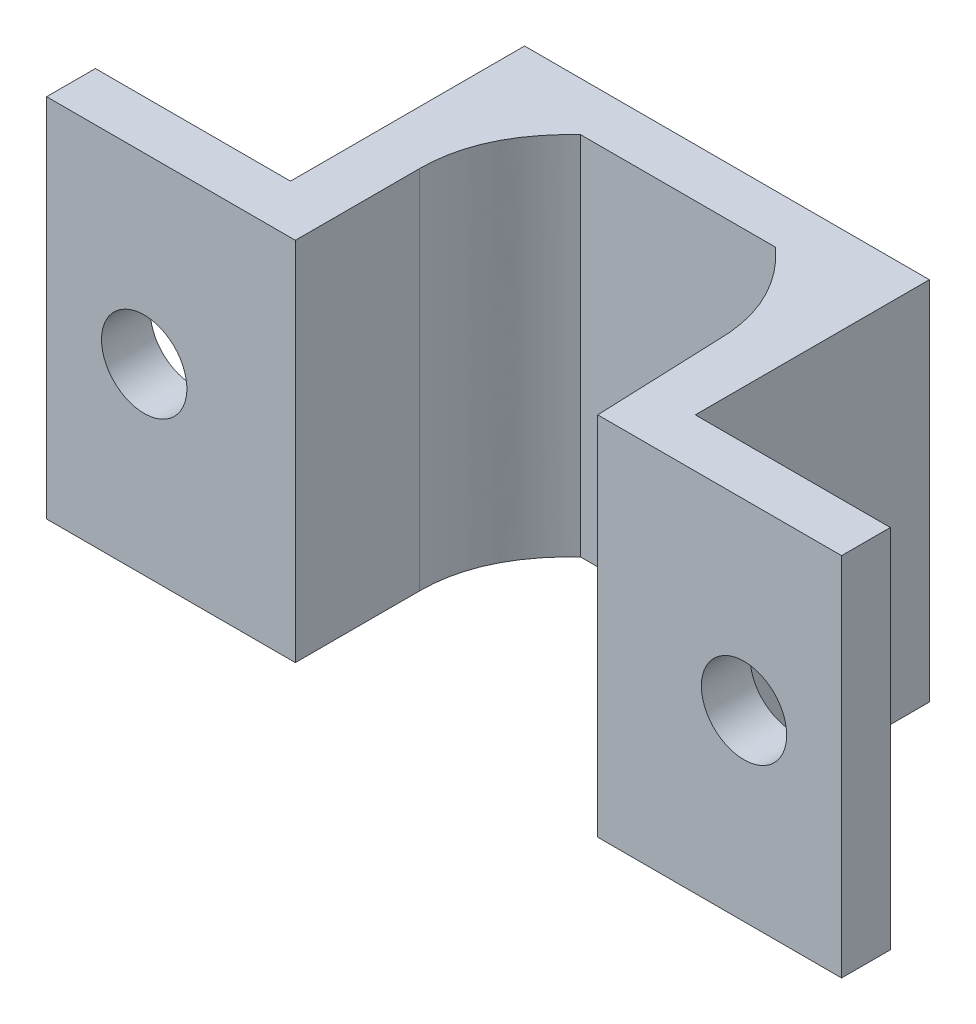
ISO-10303-21;
HEADER;
FILE_DESCRIPTION(('STEP AP214'),'2;1');
FILE_NAME('part.step','',(''),(''),'','','');
FILE_SCHEMA(('AUTOMOTIVE_DESIGN { 1 0 10303 214 1 1 1 1 }'));
ENDSEC;
DATA;
#1=APPLICATION_CONTEXT('core data for automotive mechanical design processes');
#2=APPLICATION_PROTOCOL_DEFINITION('international standard','automotive_design',2000,#1);
#3=PRODUCT_CONTEXT('',#1,'mechanical');
#4=PRODUCT('Part','Part','',(#3));
#5=PRODUCT_RELATED_PRODUCT_CATEGORY('part','',(#4));
#6=PRODUCT_DEFINITION_FORMATION('','',#4);
#7=PRODUCT_DEFINITION_CONTEXT('part definition',#1,'design');
#8=PRODUCT_DEFINITION('design','',#6,#7);
#9=PRODUCT_DEFINITION_SHAPE('','',#8);
#10=(LENGTH_UNIT() NAMED_UNIT(*) SI_UNIT(.MILLI.,.METRE.));
#11=(NAMED_UNIT(*) PLANE_ANGLE_UNIT() SI_UNIT($,.RADIAN.));
#12=(NAMED_UNIT(*) SI_UNIT($,.STERADIAN.) SOLID_ANGLE_UNIT());
#13=UNCERTAINTY_MEASURE_WITH_UNIT(LENGTH_MEASURE(1.E-05),#10,'distance_accuracy_value','');
#14=(GEOMETRIC_REPRESENTATION_CONTEXT(3) GLOBAL_UNCERTAINTY_ASSIGNED_CONTEXT((#13)) GLOBAL_UNIT_ASSIGNED_CONTEXT((#10,
#11,#12)) REPRESENTATION_CONTEXT('',''));
#15=CARTESIAN_POINT('',(0.,0.,0.));
#16=DIRECTION('',(0.,0.,1.));
#17=DIRECTION('',(1.,0.,0.));
#18=AXIS2_PLACEMENT_3D('',#15,#16,#17);
#19=CARTESIAN_POINT('',(0.200000000000002,15.,-5.1));
#20=DIRECTION('',(-1.,0.,0.));
#21=DIRECTION('',(0.,0.,1.));
#22=AXIS2_PLACEMENT_3D('',#19,#20,#21);
#23=PLANE('',#22);
#24=DIRECTION('',(0.,0.,-1.));
#25=VECTOR('',#24,1.);
#26=CARTESIAN_POINT('',(0.200000000000002,0.,-5.1));
#27=LINE('',#26,#25);
#28=CARTESIAN_POINT('',(0.200000000000002,0.,0.));
#29=VERTEX_POINT('',#28);
#30=CARTESIAN_POINT('',(0.200000000000002,0.,-5.1));
#31=VERTEX_POINT('',#30);
#32=EDGE_CURVE('E170',#29,#31,#27,.T.);
#33=ORIENTED_EDGE('',*,*,#32,.T.);
#34=DIRECTION('',(0.,-1.,0.));
#35=VECTOR('',#34,1.);
#36=CARTESIAN_POINT('',(0.200000000000002,15.,-5.1));
#37=LINE('',#36,#35);
#38=CARTESIAN_POINT('',(0.200000000000002,15.,-5.1));
#39=VERTEX_POINT('',#38);
#40=EDGE_CURVE('E42',#39,#31,#37,.T.);
#41=ORIENTED_EDGE('',*,*,#40,.F.);
#42=DIRECTION('',(0.,0.,-1.));
#43=VECTOR('',#42,1.);
#44=CARTESIAN_POINT('',(0.200000000000002,15.,-5.1));
#45=LINE('',#44,#43);
#46=CARTESIAN_POINT('',(0.200000000000002,15.,0.));
#47=VERTEX_POINT('',#46);
#48=EDGE_CURVE('E112',#47,#39,#45,.T.);
#49=ORIENTED_EDGE('',*,*,#48,.F.);
#50=DIRECTION('',(0.,-1.,0.));
#51=VECTOR('',#50,1.);
#52=CARTESIAN_POINT('',(0.200000000000002,15.,0.));
#53=LINE('',#52,#51);
#54=EDGE_CURVE('E11',#47,#29,#53,.T.);
#55=ORIENTED_EDGE('',*,*,#54,.T.);
#56=EDGE_LOOP('',(#33,#41,#49,#55));
#57=FACE_BOUND('',#56,.T.);
#58=ADVANCED_FACE('F33',(#57),#23,.F.);
#59=CARTESIAN_POINT('',(0.200000000000002,15.,-5.1));
#60=CARTESIAN_POINT('',(0.200000000000002,15.,-7.65));
#61=CARTESIAN_POINT('',(2.3,15.,-9.6));
#62=B_SPLINE_CURVE_WITH_KNOTS('',2,(#59,#60,#61),.UNSPECIFIED.,.F.,.F.,(3,3),(0.,0.5),.UNSPECIFIED.);
#63=DIRECTION('',(0.,-1.,0.));
#64=VECTOR('',#63,1.);
#65=SURFACE_OF_LINEAR_EXTRUSION('',#62,#64);
#66=CARTESIAN_POINT('',(0.200000000000002,0.,-5.1));
#67=CARTESIAN_POINT('',(0.200000000000002,0.,-7.65));
#68=CARTESIAN_POINT('',(2.3,0.,-9.6));
#69=B_SPLINE_CURVE_WITH_KNOTS('',2,(#66,#67,#68),.UNSPECIFIED.,.F.,.F.,(3,3),(0.,0.5),.UNSPECIFIED.);
#70=CARTESIAN_POINT('',(2.3,0.,-9.6));
#71=VERTEX_POINT('',#70);
#72=EDGE_CURVE('E172',#31,#71,#69,.T.);
#73=ORIENTED_EDGE('',*,*,#72,.T.);
#74=DIRECTION('',(0.,-1.,0.));
#75=VECTOR('',#74,1.);
#76=CARTESIAN_POINT('',(2.3,15.,-9.6));
#77=LINE('',#76,#75);
#78=CARTESIAN_POINT('',(2.3,15.,-9.6));
#79=VERTEX_POINT('',#78);
#80=EDGE_CURVE('E230',#79,#71,#77,.T.);
#81=ORIENTED_EDGE('',*,*,#80,.F.);
#82=EDGE_CURVE('E239',#39,#79,#62,.T.);
#83=ORIENTED_EDGE('',*,*,#82,.F.);
#84=ORIENTED_EDGE('',*,*,#40,.T.);
#85=EDGE_LOOP('',(#73,#81,#83,#84));
#86=FACE_BOUND('',#85,.T.);
#87=ADVANCED_FACE('F237',(#86),#65,.F.);
#88=CARTESIAN_POINT('',(2.3,15.,-9.6));
#89=DIRECTION('',(0.,0.,-1.));
#90=DIRECTION('',(-1.,0.,0.));
#91=AXIS2_PLACEMENT_3D('',#88,#89,#90);
#92=PLANE('',#91);
#93=DIRECTION('',(1.,0.,0.));
#94=VECTOR('',#93,1.);
#95=CARTESIAN_POINT('',(2.3,0.,-9.6));
#96=LINE('',#95,#94);
#97=CARTESIAN_POINT('',(10.3,0.,-9.6));
#98=VERTEX_POINT('',#97);
#99=EDGE_CURVE('E177',#71,#98,#96,.T.);
#100=ORIENTED_EDGE('',*,*,#99,.T.);
#101=DIRECTION('',(0.,-1.,0.));
#102=VECTOR('',#101,1.);
#103=CARTESIAN_POINT('',(10.3,15.,-9.6));
#104=LINE('',#103,#102);
#105=CARTESIAN_POINT('',(10.3,15.,-9.6));
#106=VERTEX_POINT('',#105);
#107=EDGE_CURVE('E227',#106,#98,#104,.T.);
#108=ORIENTED_EDGE('',*,*,#107,.F.);
#109=DIRECTION('',(1.,0.,0.));
#110=VECTOR('',#109,1.);
#111=CARTESIAN_POINT('',(2.3,15.,-9.6));
#112=LINE('',#111,#110);
#113=EDGE_CURVE('E258',#79,#106,#112,.T.);
#114=ORIENTED_EDGE('',*,*,#113,.F.);
#115=ORIENTED_EDGE('',*,*,#80,.T.);
#116=EDGE_LOOP('',(#100,#108,#114,#115));
#117=FACE_BOUND('',#116,.T.);
#118=ADVANCED_FACE('F249',(#117),#92,.F.);
#119=CARTESIAN_POINT('',(10.3,15.,-9.6));
#120=CARTESIAN_POINT('',(12.4,15.,-7.65));
#121=CARTESIAN_POINT('',(12.4,15.,-5.1));
#122=B_SPLINE_CURVE_WITH_KNOTS('',2,(#119,#120,#121),.UNSPECIFIED.,.F.,.F.,(3,3),(0.,0.5),.UNSPECIFIED.);
#123=DIRECTION('',(0.,-1.,0.));
#124=VECTOR('',#123,1.);
#125=SURFACE_OF_LINEAR_EXTRUSION('',#122,#124);
#126=CARTESIAN_POINT('',(10.3,0.,-9.6));
#127=CARTESIAN_POINT('',(12.4,0.,-7.65));
#128=CARTESIAN_POINT('',(12.4,0.,-5.1));
#129=B_SPLINE_CURVE_WITH_KNOTS('',2,(#126,#127,#128),.UNSPECIFIED.,.F.,.F.,(3,3),(0.,0.5),.UNSPECIFIED.);
#130=CARTESIAN_POINT('',(12.4,0.,-5.1));
#131=VERTEX_POINT('',#130);
#132=EDGE_CURVE('E182',#98,#131,#129,.T.);
#133=ORIENTED_EDGE('',*,*,#132,.T.);
#134=DIRECTION('',(0.,-1.,0.));
#135=VECTOR('',#134,1.);
#136=CARTESIAN_POINT('',(12.4,15.,-5.1));
#137=LINE('',#136,#135);
#138=CARTESIAN_POINT('',(12.4,15.,-5.1));
#139=VERTEX_POINT('',#138);
#140=EDGE_CURVE('E224',#139,#131,#137,.T.);
#141=ORIENTED_EDGE('',*,*,#140,.F.);
#142=EDGE_CURVE('E255',#106,#139,#122,.T.);
#143=ORIENTED_EDGE('',*,*,#142,.F.);
#144=ORIENTED_EDGE('',*,*,#107,.T.);
#145=EDGE_LOOP('',(#133,#141,#143,#144));
#146=FACE_BOUND('',#145,.T.);
#147=ADVANCED_FACE('F253',(#146),#125,.F.);
#148=CARTESIAN_POINT('',(12.4,15.,-5.1));
#149=DIRECTION('',(0.999231950731543,0.,-0.039185566695355));
#150=DIRECTION('',(-0.039185566695355,0.,-0.999231950731543));
#151=AXIS2_PLACEMENT_3D('',#148,#149,#150);
#152=PLANE('',#151);
#153=DIRECTION('',(0.039185566695355,0.,0.999231950731543));
#154=VECTOR('',#153,1.);
#155=CARTESIAN_POINT('',(12.4,0.,-5.1));
#156=LINE('',#155,#154);
#157=CARTESIAN_POINT('',(12.6,0.,0.));
#158=VERTEX_POINT('',#157);
#159=EDGE_CURVE('E186',#131,#158,#156,.T.);
#160=ORIENTED_EDGE('',*,*,#159,.T.);
#161=DIRECTION('',(0.,-1.,0.));
#162=VECTOR('',#161,1.);
#163=CARTESIAN_POINT('',(12.6,15.,0.));
#164=LINE('',#163,#162);
#165=CARTESIAN_POINT('',(12.6,15.,0.));
#166=VERTEX_POINT('',#165);
#167=EDGE_CURVE('E221',#166,#158,#164,.T.);
#168=ORIENTED_EDGE('',*,*,#167,.F.);
#169=DIRECTION('',(0.039185566695355,0.,0.999231950731543));
#170=VECTOR('',#169,1.);
#171=CARTESIAN_POINT('',(12.4,15.,-5.1));
#172=LINE('',#171,#170);
#173=EDGE_CURVE('E257',#139,#166,#172,.T.);
#174=ORIENTED_EDGE('',*,*,#173,.F.);
#175=ORIENTED_EDGE('',*,*,#140,.T.);
#176=EDGE_LOOP('',(#160,#168,#174,#175));
#177=FACE_BOUND('',#176,.T.);
#178=ADVANCED_FACE('F275',(#177),#152,.F.);
#179=CARTESIAN_POINT('',(12.6,15.,0.));
#180=DIRECTION('',(0.,0.,-1.));
#181=DIRECTION('',(-1.,0.,0.));
#182=AXIS2_PLACEMENT_3D('',#179,#180,#181);
#183=PLANE('',#182);
#184=CARTESIAN_POINT('',(18.6,7.5,0.));
#185=DIRECTION('',(0.,0.,-1.));
#186=DIRECTION('',(-1.,0.,0.));
#187=AXIS2_PLACEMENT_3D('',#184,#185,#186);
#188=CIRCLE('',#187,1.75);
#189=CARTESIAN_POINT('',(16.85,7.5,0.));
#190=VERTEX_POINT('',#189);
#191=EDGE_CURVE('E173',#190,#190,#188,.T.);
#192=ORIENTED_EDGE('',*,*,#191,.T.);
#193=EDGE_LOOP('',(#192));
#194=FACE_BOUND('',#193,.T.);
#195=DIRECTION('',(1.,0.,0.));
#196=VECTOR('',#195,1.);
#197=CARTESIAN_POINT('',(12.6,0.,0.));
#198=LINE('',#197,#196);
#199=CARTESIAN_POINT('',(22.6,0.,0.));
#200=VERTEX_POINT('',#199);
#201=EDGE_CURVE('E191',#158,#200,#198,.T.);
#202=ORIENTED_EDGE('',*,*,#201,.T.);
#203=DIRECTION('',(0.,-1.,0.));
#204=VECTOR('',#203,1.);
#205=CARTESIAN_POINT('',(22.6,15.,0.));
#206=LINE('',#205,#204);
#207=CARTESIAN_POINT('',(22.6,15.,0.));
#208=VERTEX_POINT('',#207);
#209=EDGE_CURVE('E218',#208,#200,#206,.T.);
#210=ORIENTED_EDGE('',*,*,#209,.F.);
#211=DIRECTION('',(1.,0.,0.));
#212=VECTOR('',#211,1.);
#213=CARTESIAN_POINT('',(12.6,15.,0.));
#214=LINE('',#213,#212);
#215=EDGE_CURVE('E260',#166,#208,#214,.T.);
#216=ORIENTED_EDGE('',*,*,#215,.F.);
#217=ORIENTED_EDGE('',*,*,#167,.T.);
#218=EDGE_LOOP('',(#202,#210,#216,#217));
#219=FACE_BOUND('',#218,.T.);
#220=ADVANCED_FACE('F339',(#194,#219),#183,.F.);
#221=CARTESIAN_POINT('',(22.6,15.,0.));
#222=DIRECTION('',(-1.,0.,0.));
#223=DIRECTION('',(0.,0.,1.));
#224=AXIS2_PLACEMENT_3D('',#221,#222,#223);
#225=PLANE('',#224);
#226=DIRECTION('',(0.,0.,-1.));
#227=VECTOR('',#226,1.);
#228=CARTESIAN_POINT('',(22.6,0.,0.));
#229=LINE('',#228,#227);
#230=CARTESIAN_POINT('',(22.6,0.,-2.));
#231=VERTEX_POINT('',#230);
#232=EDGE_CURVE('E193',#200,#231,#229,.T.);
#233=ORIENTED_EDGE('',*,*,#232,.T.);
#234=DIRECTION('',(0.,-1.,0.));
#235=VECTOR('',#234,1.);
#236=CARTESIAN_POINT('',(22.6,15.,-2.));
#237=LINE('',#236,#235);
#238=CARTESIAN_POINT('',(22.6,15.,-2.));
#239=VERTEX_POINT('',#238);
#240=EDGE_CURVE('E215',#239,#231,#237,.T.);
#241=ORIENTED_EDGE('',*,*,#240,.F.);
#242=DIRECTION('',(0.,0.,-1.));
#243=VECTOR('',#242,1.);
#244=CARTESIAN_POINT('',(22.6,15.,0.));
#245=LINE('',#244,#243);
#246=EDGE_CURVE('E336',#208,#239,#245,.T.);
#247=ORIENTED_EDGE('',*,*,#246,.F.);
#248=ORIENTED_EDGE('',*,*,#209,.T.);
#249=EDGE_LOOP('',(#233,#241,#247,#248));
#250=FACE_BOUND('',#249,.T.);
#251=ADVANCED_FACE('F333',(#250),#225,.F.);
#252=CARTESIAN_POINT('',(22.6,15.,-2.));
#253=DIRECTION('',(0.,0.,1.));
#254=DIRECTION('',(1.,0.,0.));
#255=AXIS2_PLACEMENT_3D('',#252,#253,#254);
#256=PLANE('',#255);
#257=CARTESIAN_POINT('',(18.6,7.5,-2.));
#258=DIRECTION('',(0.,0.,-1.));
#259=DIRECTION('',(-1.,0.,0.));
#260=AXIS2_PLACEMENT_3D('',#257,#258,#259);
#261=CIRCLE('',#260,1.75);
#262=CARTESIAN_POINT('',(16.85,7.5,-2.));
#263=VERTEX_POINT('',#262);
#264=EDGE_CURVE('E290',#263,#263,#261,.T.);
#265=ORIENTED_EDGE('',*,*,#264,.F.);
#266=EDGE_LOOP('',(#265));
#267=FACE_BOUND('',#266,.T.);
#268=DIRECTION('',(-1.,0.,0.));
#269=VECTOR('',#268,1.);
#270=CARTESIAN_POINT('',(22.6,0.,-2.));
#271=LINE('',#270,#269);
#272=CARTESIAN_POINT('',(14.6,0.,-2.));
#273=VERTEX_POINT('',#272);
#274=EDGE_CURVE('E195',#231,#273,#271,.T.);
#275=ORIENTED_EDGE('',*,*,#274,.T.);
#276=DIRECTION('',(0.,-1.,0.));
#277=VECTOR('',#276,1.);
#278=CARTESIAN_POINT('',(14.6,15.,-2.));
#279=LINE('',#278,#277);
#280=CARTESIAN_POINT('',(14.6,15.,-2.));
#281=VERTEX_POINT('',#280);
#282=EDGE_CURVE('E212',#281,#273,#279,.T.);
#283=ORIENTED_EDGE('',*,*,#282,.F.);
#284=DIRECTION('',(-1.,0.,0.));
#285=VECTOR('',#284,1.);
#286=CARTESIAN_POINT('',(22.6,15.,-2.));
#287=LINE('',#286,#285);
#288=EDGE_CURVE('E328',#239,#281,#287,.T.);
#289=ORIENTED_EDGE('',*,*,#288,.F.);
#290=ORIENTED_EDGE('',*,*,#240,.T.);
#291=EDGE_LOOP('',(#275,#283,#289,#290));
#292=FACE_BOUND('',#291,.T.);
#293=ADVANCED_FACE('F327',(#267,#292),#256,.F.);
#294=CARTESIAN_POINT('',(14.6,15.,-2.));
#295=DIRECTION('',(-1.,0.,0.));
#296=DIRECTION('',(0.,0.,1.));
#297=AXIS2_PLACEMENT_3D('',#294,#295,#296);
#298=PLANE('',#297);
#299=DIRECTION('',(0.,0.,-1.));
#300=VECTOR('',#299,1.);
#301=CARTESIAN_POINT('',(14.6,0.,-2.));
#302=LINE('',#301,#300);
#303=CARTESIAN_POINT('',(14.6,0.,-11.6));
#304=VERTEX_POINT('',#303);
#305=EDGE_CURVE('E197',#273,#304,#302,.T.);
#306=ORIENTED_EDGE('',*,*,#305,.T.);
#307=DIRECTION('',(0.,-1.,0.));
#308=VECTOR('',#307,1.);
#309=CARTESIAN_POINT('',(14.6,15.,-11.6));
#310=LINE('',#309,#308);
#311=CARTESIAN_POINT('',(14.6,15.,-11.6));
#312=VERTEX_POINT('',#311);
#313=EDGE_CURVE('E209',#312,#304,#310,.T.);
#314=ORIENTED_EDGE('',*,*,#313,.F.);
#315=DIRECTION('',(0.,0.,-1.));
#316=VECTOR('',#315,1.);
#317=CARTESIAN_POINT('',(14.6,15.,-2.));
#318=LINE('',#317,#316);
#319=EDGE_CURVE('E323',#281,#312,#318,.T.);
#320=ORIENTED_EDGE('',*,*,#319,.F.);
#321=ORIENTED_EDGE('',*,*,#282,.T.);
#322=EDGE_LOOP('',(#306,#314,#320,#321));
#323=FACE_BOUND('',#322,.T.);
#324=ADVANCED_FACE('F322',(#323),#298,.F.);
#325=CARTESIAN_POINT('',(-2.,15.,-11.6));
#326=DIRECTION('',(0.,0.,1.));
#327=DIRECTION('',(1.,0.,0.));
#328=AXIS2_PLACEMENT_3D('',#325,#326,#327);
#329=PLANE('',#328);
#330=DIRECTION('',(-1.,0.,0.));
#331=VECTOR('',#330,1.);
#332=CARTESIAN_POINT('',(-2.,0.,-11.6));
#333=LINE('',#332,#331);
#334=CARTESIAN_POINT('',(-2.,0.,-11.6));
#335=VERTEX_POINT('',#334);
#336=EDGE_CURVE('E199',#304,#335,#333,.T.);
#337=ORIENTED_EDGE('',*,*,#336,.T.);
#338=DIRECTION('',(0.,-1.,0.));
#339=VECTOR('',#338,1.);
#340=CARTESIAN_POINT('',(-2.,15.,-11.6));
#341=LINE('',#340,#339);
#342=CARTESIAN_POINT('',(-2.,15.,-11.6));
#343=VERTEX_POINT('',#342);
#344=EDGE_CURVE('E159',#343,#335,#341,.T.);
#345=ORIENTED_EDGE('',*,*,#344,.F.);
#346=DIRECTION('',(-1.,0.,0.));
#347=VECTOR('',#346,1.);
#348=CARTESIAN_POINT('',(-2.,15.,-11.6));
#349=LINE('',#348,#347);
#350=EDGE_CURVE('E150',#312,#343,#349,.T.);
#351=ORIENTED_EDGE('',*,*,#350,.F.);
#352=ORIENTED_EDGE('',*,*,#313,.T.);
#353=EDGE_LOOP('',(#337,#345,#351,#352));
#354=FACE_BOUND('',#353,.T.);
#355=ADVANCED_FACE('F318',(#354),#329,.F.);
#356=CARTESIAN_POINT('',(-2.,15.,-2.));
#357=DIRECTION('',(1.,0.,0.));
#358=DIRECTION('',(0.,0.,-1.));
#359=AXIS2_PLACEMENT_3D('',#356,#357,#358);
#360=PLANE('',#359);
#361=DIRECTION('',(0.,0.,1.));
#362=VECTOR('',#361,1.);
#363=CARTESIAN_POINT('',(-2.,0.,-2.));
#364=LINE('',#363,#362);
#365=CARTESIAN_POINT('',(-2.,0.,-2.));
#366=VERTEX_POINT('',#365);
#367=EDGE_CURVE('E158',#335,#366,#364,.T.);
#368=ORIENTED_EDGE('',*,*,#367,.T.);
#369=DIRECTION('',(0.,-1.,0.));
#370=VECTOR('',#369,1.);
#371=CARTESIAN_POINT('',(-2.,15.,-2.));
#372=LINE('',#371,#370);
#373=CARTESIAN_POINT('',(-2.,15.,-2.));
#374=VERTEX_POINT('',#373);
#375=EDGE_CURVE('E155',#374,#366,#372,.T.);
#376=ORIENTED_EDGE('',*,*,#375,.F.);
#377=DIRECTION('',(0.,0.,1.));
#378=VECTOR('',#377,1.);
#379=CARTESIAN_POINT('',(-2.,15.,-2.));
#380=LINE('',#379,#378);
#381=EDGE_CURVE('E144',#343,#374,#380,.T.);
#382=ORIENTED_EDGE('',*,*,#381,.F.);
#383=ORIENTED_EDGE('',*,*,#344,.T.);
#384=EDGE_LOOP('',(#368,#376,#382,#383));
#385=FACE_BOUND('',#384,.T.);
#386=ADVANCED_FACE('F156',(#385),#360,.F.);
#387=CARTESIAN_POINT('',(-10.,15.,-2.));
#388=DIRECTION('',(0.,0.,1.));
#389=DIRECTION('',(1.,0.,0.));
#390=AXIS2_PLACEMENT_3D('',#387,#388,#389);
#391=PLANE('',#390);
#392=CARTESIAN_POINT('',(-6.,7.5,-2.));
#393=DIRECTION('',(0.,0.,-1.));
#394=DIRECTION('',(-1.,0.,0.));
#395=AXIS2_PLACEMENT_3D('',#392,#393,#394);
#396=CIRCLE('',#395,1.75);
#397=CARTESIAN_POINT('',(-7.75,7.5,-2.));
#398=VERTEX_POINT('',#397);
#399=EDGE_CURVE('E293',#398,#398,#396,.T.);
#400=ORIENTED_EDGE('',*,*,#399,.F.);
#401=EDGE_LOOP('',(#400));
#402=FACE_BOUND('',#401,.T.);
#403=DIRECTION('',(-1.,0.,0.));
#404=VECTOR('',#403,1.);
#405=CARTESIAN_POINT('',(-10.,0.,-2.));
#406=LINE('',#405,#404);
#407=CARTESIAN_POINT('',(-10.,0.,-2.));
#408=VERTEX_POINT('',#407);
#409=EDGE_CURVE('E98',#366,#408,#406,.T.);
#410=ORIENTED_EDGE('',*,*,#409,.T.);
#411=DIRECTION('',(0.,-1.,0.));
#412=VECTOR('',#411,1.);
#413=CARTESIAN_POINT('',(-10.,15.,-2.));
#414=LINE('',#413,#412);
#415=CARTESIAN_POINT('',(-10.,15.,-2.));
#416=VERTEX_POINT('',#415);
#417=EDGE_CURVE('E160',#416,#408,#414,.T.);
#418=ORIENTED_EDGE('',*,*,#417,.F.);
#419=DIRECTION('',(-1.,0.,0.));
#420=VECTOR('',#419,1.);
#421=CARTESIAN_POINT('',(-10.,15.,-2.));
#422=LINE('',#421,#420);
#423=EDGE_CURVE('E148',#374,#416,#422,.T.);
#424=ORIENTED_EDGE('',*,*,#423,.F.);
#425=ORIENTED_EDGE('',*,*,#375,.T.);
#426=EDGE_LOOP('',(#410,#418,#424,#425));
#427=FACE_BOUND('',#426,.T.);
#428=ADVANCED_FACE('F162',(#402,#427),#391,.F.);
#429=CARTESIAN_POINT('',(-10.,15.,0.));
#430=DIRECTION('',(1.,0.,0.));
#431=DIRECTION('',(0.,0.,-1.));
#432=AXIS2_PLACEMENT_3D('',#429,#430,#431);
#433=PLANE('',#432);
#434=DIRECTION('',(0.,0.,1.));
#435=VECTOR('',#434,1.);
#436=CARTESIAN_POINT('',(-10.,0.,0.));
#437=LINE('',#436,#435);
#438=CARTESIAN_POINT('',(-10.,0.,0.));
#439=VERTEX_POINT('',#438);
#440=EDGE_CURVE('E105',#408,#439,#437,.T.);
#441=ORIENTED_EDGE('',*,*,#440,.T.);
#442=DIRECTION('',(0.,-1.,0.));
#443=VECTOR('',#442,1.);
#444=CARTESIAN_POINT('',(-10.,15.,0.));
#445=LINE('',#444,#443);
#446=CARTESIAN_POINT('',(-10.,15.,0.));
#447=VERTEX_POINT('',#446);
#448=EDGE_CURVE('E166',#447,#439,#445,.T.);
#449=ORIENTED_EDGE('',*,*,#448,.F.);
#450=DIRECTION('',(0.,0.,1.));
#451=VECTOR('',#450,1.);
#452=CARTESIAN_POINT('',(-10.,15.,0.));
#453=LINE('',#452,#451);
#454=EDGE_CURVE('E164',#416,#447,#453,.T.);
#455=ORIENTED_EDGE('',*,*,#454,.F.);
#456=ORIENTED_EDGE('',*,*,#417,.T.);
#457=EDGE_LOOP('',(#441,#449,#455,#456));
#458=FACE_BOUND('',#457,.T.);
#459=ADVANCED_FACE('F366',(#458),#433,.F.);
#460=CARTESIAN_POINT('',(0.,15.,0.));
#461=DIRECTION('',(0.,0.,-1.));
#462=DIRECTION('',(-1.,0.,0.));
#463=AXIS2_PLACEMENT_3D('',#460,#461,#462);
#464=PLANE('',#463);
#465=CARTESIAN_POINT('',(-6.,7.5,0.));
#466=DIRECTION('',(0.,0.,-1.));
#467=DIRECTION('',(-1.,0.,0.));
#468=AXIS2_PLACEMENT_3D('',#465,#466,#467);
#469=CIRCLE('',#468,1.75);
#470=CARTESIAN_POINT('',(-7.75,7.5,0.));
#471=VERTEX_POINT('',#470);
#472=EDGE_CURVE('E36',#471,#471,#469,.T.);
#473=ORIENTED_EDGE('',*,*,#472,.T.);
#474=EDGE_LOOP('',(#473));
#475=FACE_BOUND('',#474,.T.);
#476=DIRECTION('',(1.,0.,0.));
#477=VECTOR('',#476,1.);
#478=CARTESIAN_POINT('',(0.,0.,0.));
#479=LINE('',#478,#477);
#480=EDGE_CURVE('E204',#439,#29,#479,.T.);
#481=ORIENTED_EDGE('',*,*,#480,.T.);
#482=ORIENTED_EDGE('',*,*,#54,.F.);
#483=DIRECTION('',(1.,0.,0.));
#484=VECTOR('',#483,1.);
#485=CARTESIAN_POINT('',(0.200000000000002,15.,0.));
#486=LINE('',#485,#484);
#487=EDGE_CURVE('E50',#447,#47,#486,.T.);
#488=ORIENTED_EDGE('',*,*,#487,.F.);
#489=ORIENTED_EDGE('',*,*,#448,.T.);
#490=EDGE_LOOP('',(#481,#482,#488,#489));
#491=FACE_BOUND('',#490,.T.);
#492=ADVANCED_FACE('F300',(#475,#491),#464,.F.);
#493=CARTESIAN_POINT('',(11.875,15.,-7.5));
#494=DIRECTION('',(0.,1.,0.));
#495=DIRECTION('',(0.,0.,1.));
#496=AXIS2_PLACEMENT_3D('',#493,#494,#495);
#497=PLANE('',#496);
#498=ORIENTED_EDGE('',*,*,#487,.T.);
#499=ORIENTED_EDGE('',*,*,#48,.T.);
#500=ORIENTED_EDGE('',*,*,#82,.T.);
#501=ORIENTED_EDGE('',*,*,#113,.T.);
#502=ORIENTED_EDGE('',*,*,#142,.T.);
#503=ORIENTED_EDGE('',*,*,#173,.T.);
#504=ORIENTED_EDGE('',*,*,#215,.T.);
#505=ORIENTED_EDGE('',*,*,#246,.T.);
#506=ORIENTED_EDGE('',*,*,#288,.T.);
#507=ORIENTED_EDGE('',*,*,#319,.T.);
#508=ORIENTED_EDGE('',*,*,#350,.T.);
#509=ORIENTED_EDGE('',*,*,#381,.T.);
#510=ORIENTED_EDGE('',*,*,#423,.T.);
#511=ORIENTED_EDGE('',*,*,#454,.T.);
#512=EDGE_LOOP('',(#498,#499,#500,#501,#502,#503,#504,#505,#506,#507,#508,#509,#510,#511));
#513=FACE_BOUND('',#512,.T.);
#514=ADVANCED_FACE('F146',(#513),#497,.T.);
#515=CARTESIAN_POINT('',(11.875,0.,-7.5));
#516=DIRECTION('',(0.,1.,0.));
#517=DIRECTION('',(0.,0.,1.));
#518=AXIS2_PLACEMENT_3D('',#515,#516,#517);
#519=PLANE('',#518);
#520=ORIENTED_EDGE('',*,*,#32,.F.);
#521=ORIENTED_EDGE('',*,*,#480,.F.);
#522=ORIENTED_EDGE('',*,*,#440,.F.);
#523=ORIENTED_EDGE('',*,*,#409,.F.);
#524=ORIENTED_EDGE('',*,*,#367,.F.);
#525=ORIENTED_EDGE('',*,*,#336,.F.);
#526=ORIENTED_EDGE('',*,*,#305,.F.);
#527=ORIENTED_EDGE('',*,*,#274,.F.);
#528=ORIENTED_EDGE('',*,*,#232,.F.);
#529=ORIENTED_EDGE('',*,*,#201,.F.);
#530=ORIENTED_EDGE('',*,*,#159,.F.);
#531=ORIENTED_EDGE('',*,*,#132,.F.);
#532=ORIENTED_EDGE('',*,*,#99,.F.);
#533=ORIENTED_EDGE('',*,*,#72,.F.);
#534=EDGE_LOOP('',(#520,#521,#522,#523,#524,#525,#526,#527,#528,#529,#530,#531,#532,#533));
#535=FACE_BOUND('',#534,.T.);
#536=ADVANCED_FACE('F243',(#535),#519,.F.);
#537=CARTESIAN_POINT('',(18.6,7.5,13.));
#538=DIRECTION('',(0.,0.,-1.));
#539=DIRECTION('',(-1.,0.,0.));
#540=AXIS2_PLACEMENT_3D('',#537,#538,#539);
#541=CYLINDRICAL_SURFACE('',#540,1.75);
#542=ORIENTED_EDGE('',*,*,#264,.T.);
#543=EDGE_LOOP('',(#542));
#544=FACE_BOUND('',#543,.T.);
#545=ORIENTED_EDGE('',*,*,#191,.F.);
#546=EDGE_LOOP('',(#545));
#547=FACE_BOUND('',#546,.T.);
#548=ADVANCED_FACE('F304',(#544,#547),#541,.F.);
#549=CARTESIAN_POINT('',(-6.,7.5,13.));
#550=DIRECTION('',(0.,0.,-1.));
#551=DIRECTION('',(-1.,0.,0.));
#552=AXIS2_PLACEMENT_3D('',#549,#550,#551);
#553=CYLINDRICAL_SURFACE('',#552,1.75);
#554=ORIENTED_EDGE('',*,*,#399,.T.);
#555=EDGE_LOOP('',(#554));
#556=FACE_BOUND('',#555,.T.);
#557=ORIENTED_EDGE('',*,*,#472,.F.);
#558=EDGE_LOOP('',(#557));
#559=FACE_BOUND('',#558,.T.);
#560=ADVANCED_FACE('F302',(#556,#559),#553,.F.);
#561=CLOSED_SHELL('',(#58,#87,#118,#147,#178,#220,#251,#293,#324,#355,#386,#428,#459,#492,#514,
#536,#548,#560));
#562=MANIFOLD_SOLID_BREP('B2',#561);
#563=ADVANCED_BREP_SHAPE_REPRESENTATION('',(#18,#562),#14);
#564=SHAPE_DEFINITION_REPRESENTATION(#9,#563);
ENDSEC;
END-ISO-10303-21;
